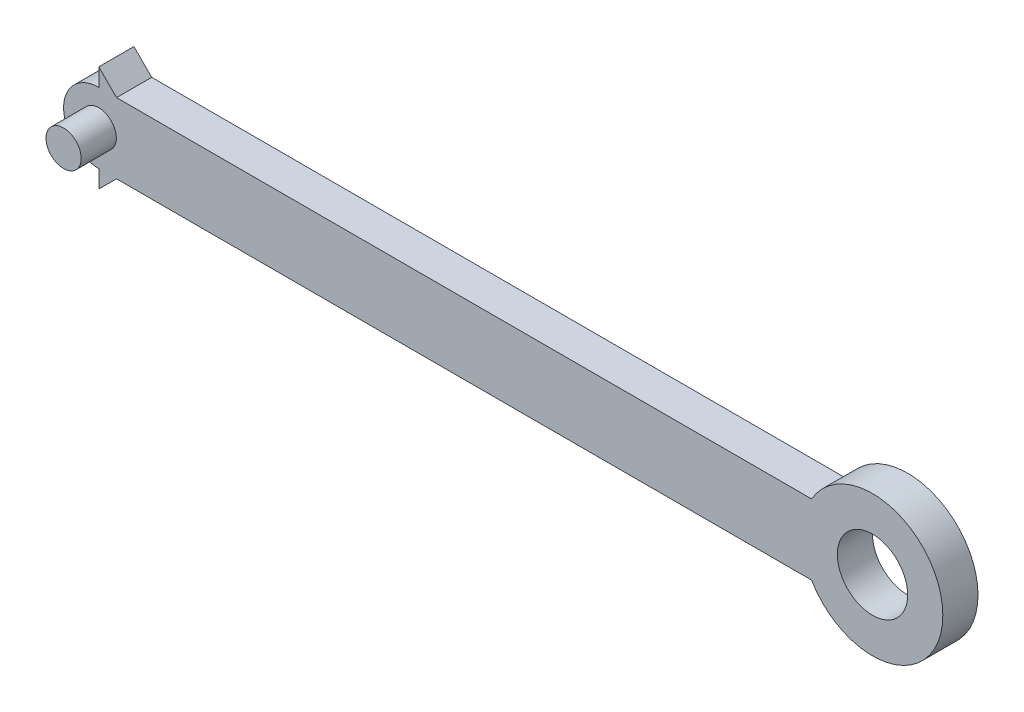
ISO-10303-21;
HEADER;
FILE_DESCRIPTION(('STEP AP214'),'2;1');
FILE_NAME('part.step','',(''),(''),'','','');
FILE_SCHEMA(('AUTOMOTIVE_DESIGN { 1 0 10303 214 1 1 1 1 }'));
ENDSEC;
DATA;
#1=APPLICATION_CONTEXT('core data for automotive mechanical design processes');
#2=APPLICATION_PROTOCOL_DEFINITION('international standard','automotive_design',2000,#1);
#3=PRODUCT_CONTEXT('',#1,'mechanical');
#4=PRODUCT('Part','Part','',(#3));
#5=PRODUCT_RELATED_PRODUCT_CATEGORY('part','',(#4));
#6=PRODUCT_DEFINITION_FORMATION('','',#4);
#7=PRODUCT_DEFINITION_CONTEXT('part definition',#1,'design');
#8=PRODUCT_DEFINITION('design','',#6,#7);
#9=PRODUCT_DEFINITION_SHAPE('','',#8);
#10=(LENGTH_UNIT() NAMED_UNIT(*) SI_UNIT(.MILLI.,.METRE.));
#11=(NAMED_UNIT(*) PLANE_ANGLE_UNIT() SI_UNIT($,.RADIAN.));
#12=(NAMED_UNIT(*) SI_UNIT($,.STERADIAN.) SOLID_ANGLE_UNIT());
#13=UNCERTAINTY_MEASURE_WITH_UNIT(LENGTH_MEASURE(1.E-05),#10,'distance_accuracy_value','');
#14=(GEOMETRIC_REPRESENTATION_CONTEXT(3) GLOBAL_UNCERTAINTY_ASSIGNED_CONTEXT((#13)) GLOBAL_UNIT_ASSIGNED_CONTEXT((#10,
#11,#12)) REPRESENTATION_CONTEXT('',''));
#15=CARTESIAN_POINT('',(0.,0.,0.));
#16=DIRECTION('',(0.,0.,1.));
#17=DIRECTION('',(1.,0.,0.));
#18=AXIS2_PLACEMENT_3D('',#15,#16,#17);
#19=CARTESIAN_POINT('',(-220.,0.,20.));
#20=DIRECTION('',(0.,0.,-1.));
#21=DIRECTION('',(-1.,0.,0.));
#22=AXIS2_PLACEMENT_3D('',#19,#20,#21);
#23=CYLINDRICAL_SURFACE('',#22,20.);
#24=CARTESIAN_POINT('',(-220.,0.,0.));
#25=DIRECTION('',(0.,0.,1.));
#26=DIRECTION('',(1.,0.,0.));
#27=AXIS2_PLACEMENT_3D('',#24,#25,#26);
#28=CIRCLE('',#27,20.);
#29=CARTESIAN_POINT('',(-220.,20.,0.));
#30=VERTEX_POINT('',#29);
#31=CARTESIAN_POINT('',(-220.,-20.,0.));
#32=VERTEX_POINT('',#31);
#33=EDGE_CURVE('E115',#30,#32,#28,.T.);
#34=ORIENTED_EDGE('',*,*,#33,.T.);
#35=DIRECTION('',(0.,0.,-1.));
#36=VECTOR('',#35,1.);
#37=CARTESIAN_POINT('',(-220.,-20.,20.));
#38=LINE('',#37,#36);
#39=CARTESIAN_POINT('',(-220.,-20.,20.));
#40=VERTEX_POINT('',#39);
#41=EDGE_CURVE('E11',#40,#32,#38,.T.);
#42=ORIENTED_EDGE('',*,*,#41,.F.);
#43=CARTESIAN_POINT('',(-220.,0.,20.));
#44=DIRECTION('',(0.,0.,1.));
#45=DIRECTION('',(1.,0.,0.));
#46=AXIS2_PLACEMENT_3D('',#43,#44,#45);
#47=CIRCLE('',#46,20.);
#48=CARTESIAN_POINT('',(-220.,20.,20.));
#49=VERTEX_POINT('',#48);
#50=EDGE_CURVE('E160',#49,#40,#47,.T.);
#51=ORIENTED_EDGE('',*,*,#50,.F.);
#52=DIRECTION('',(0.,0.,-1.));
#53=VECTOR('',#52,1.);
#54=CARTESIAN_POINT('',(-220.,20.,20.));
#55=LINE('',#54,#53);
#56=EDGE_CURVE('E44',#49,#30,#55,.T.);
#57=ORIENTED_EDGE('',*,*,#56,.T.);
#58=EDGE_LOOP('',(#34,#42,#51,#57));
#59=FACE_BOUND('',#58,.T.);
#60=ADVANCED_FACE('F37',(#59),#23,.T.);
#61=CARTESIAN_POINT('',(-220.,-20.,20.));
#62=DIRECTION('',(0.,1.,0.));
#63=DIRECTION('',(0.,0.,1.));
#64=AXIS2_PLACEMENT_3D('',#61,#62,#63);
#65=PLANE('',#64);
#66=DIRECTION('',(1.,0.,0.));
#67=VECTOR('',#66,1.);
#68=CARTESIAN_POINT('',(-220.,-20.,20.));
#69=LINE('',#68,#67);
#70=CARTESIAN_POINT('',(-209.887839651289,-20.,20.));
#71=VERTEX_POINT('',#70);
#72=CARTESIAN_POINT('',(185.358983848623,-20.,20.));
#73=VERTEX_POINT('',#72);
#74=EDGE_CURVE('E59',#71,#73,#69,.T.);
#75=ORIENTED_EDGE('',*,*,#74,.F.);
#76=DIRECTION('',(0.,0.,1.));
#77=VECTOR('',#76,1.);
#78=CARTESIAN_POINT('',(-209.887839651289,-20.,0.));
#79=LINE('',#78,#77);
#80=CARTESIAN_POINT('',(-209.887839651289,-20.,0.));
#81=VERTEX_POINT('',#80);
#82=EDGE_CURVE('E138',#81,#71,#79,.T.);
#83=ORIENTED_EDGE('',*,*,#82,.F.);
#84=DIRECTION('',(1.,0.,0.));
#85=VECTOR('',#84,1.);
#86=CARTESIAN_POINT('',(-220.,-20.,0.));
#87=LINE('',#86,#85);
#88=CARTESIAN_POINT('',(185.358983848623,-20.,0.));
#89=VERTEX_POINT('',#88);
#90=EDGE_CURVE('E167',#81,#89,#87,.T.);
#91=ORIENTED_EDGE('',*,*,#90,.T.);
#92=DIRECTION('',(0.,0.,1.));
#93=VECTOR('',#92,1.);
#94=CARTESIAN_POINT('',(185.358983848623,-20.,0.));
#95=LINE('',#94,#93);
#96=EDGE_CURVE('E155',#89,#73,#95,.T.);
#97=ORIENTED_EDGE('',*,*,#96,.T.);
#98=EDGE_LOOP('',(#75,#83,#91,#97));
#99=FACE_BOUND('',#98,.T.);
#100=ADVANCED_FACE('F185',(#99),#65,.F.);
#101=CARTESIAN_POINT('',(-220.,20.,20.));
#102=DIRECTION('',(0.,1.,0.));
#103=DIRECTION('',(0.,0.,1.));
#104=AXIS2_PLACEMENT_3D('',#101,#102,#103);
#105=PLANE('',#104);
#106=DIRECTION('',(0.,0.,1.));
#107=VECTOR('',#106,1.);
#108=CARTESIAN_POINT('',(-209.887839651289,20.,0.));
#109=LINE('',#108,#107);
#110=CARTESIAN_POINT('',(-209.887839651289,20.,0.));
#111=VERTEX_POINT('',#110);
#112=CARTESIAN_POINT('',(-209.887839651289,20.,20.));
#113=VERTEX_POINT('',#112);
#114=EDGE_CURVE('E110',#111,#113,#109,.T.);
#115=ORIENTED_EDGE('',*,*,#114,.T.);
#116=DIRECTION('',(1.,0.,0.));
#117=VECTOR('',#116,1.);
#118=CARTESIAN_POINT('',(-220.,20.,20.));
#119=LINE('',#118,#117);
#120=CARTESIAN_POINT('',(185.358983848623,20.,20.));
#121=VERTEX_POINT('',#120);
#122=EDGE_CURVE('E164',#113,#121,#119,.T.);
#123=ORIENTED_EDGE('',*,*,#122,.T.);
#124=DIRECTION('',(0.,0.,1.));
#125=VECTOR('',#124,1.);
#126=CARTESIAN_POINT('',(185.358983848623,20.,0.));
#127=LINE('',#126,#125);
#128=CARTESIAN_POINT('',(185.358983848623,20.,0.));
#129=VERTEX_POINT('',#128);
#130=EDGE_CURVE('E150',#129,#121,#127,.T.);
#131=ORIENTED_EDGE('',*,*,#130,.F.);
#132=DIRECTION('',(1.,0.,0.));
#133=VECTOR('',#132,1.);
#134=CARTESIAN_POINT('',(-220.,20.,0.));
#135=LINE('',#134,#133);
#136=EDGE_CURVE('E162',#111,#129,#135,.T.);
#137=ORIENTED_EDGE('',*,*,#136,.F.);
#138=EDGE_LOOP('',(#115,#123,#131,#137));
#139=FACE_BOUND('',#138,.T.);
#140=ADVANCED_FACE('F177',(#139),#105,.T.);
#141=CARTESIAN_POINT('',(-220.,0.,20.));
#142=DIRECTION('',(0.,0.,1.));
#143=DIRECTION('',(1.,0.,0.));
#144=AXIS2_PLACEMENT_3D('',#141,#142,#143);
#145=PLANE('',#144);
#146=CARTESIAN_POINT('',(220.,0.,20.));
#147=DIRECTION('',(0.,0.,-1.));
#148=DIRECTION('',(-1.,0.,0.));
#149=AXIS2_PLACEMENT_3D('',#146,#147,#148);
#150=CIRCLE('',#149,20.);
#151=CARTESIAN_POINT('',(200.,0.,20.));
#152=VERTEX_POINT('',#151);
#153=EDGE_CURVE('E127',#152,#152,#150,.T.);
#154=ORIENTED_EDGE('',*,*,#153,.T.);
#155=EDGE_LOOP('',(#154));
#156=FACE_BOUND('',#155,.T.);
#157=ORIENTED_EDGE('',*,*,#50,.T.);
#158=DIRECTION('',(0.,-1.,0.));
#159=VECTOR('',#158,1.);
#160=CARTESIAN_POINT('',(-220.,-20.,20.));
#161=LINE('',#160,#159);
#162=CARTESIAN_POINT('',(-220.,-30.1121603487118,20.));
#163=VERTEX_POINT('',#162);
#164=EDGE_CURVE('E135',#40,#163,#161,.T.);
#165=ORIENTED_EDGE('',*,*,#164,.T.);
#166=DIRECTION('',(0.707106781186534,0.707106781186561,0.));
#167=VECTOR('',#166,1.);
#168=CARTESIAN_POINT('',(-220.,-30.1121603487118,20.));
#169=LINE('',#168,#167);
#170=EDGE_CURVE('E129',#163,#71,#169,.T.);
#171=ORIENTED_EDGE('',*,*,#170,.T.);
#172=ORIENTED_EDGE('',*,*,#74,.T.);
#173=CARTESIAN_POINT('',(220.,0.,20.));
#174=DIRECTION('',(0.,0.,1.));
#175=DIRECTION('',(1.,0.,0.));
#176=AXIS2_PLACEMENT_3D('',#173,#174,#175);
#177=CIRCLE('',#176,40.);
#178=EDGE_CURVE('E145',#73,#121,#177,.T.);
#179=ORIENTED_EDGE('',*,*,#178,.T.);
#180=ORIENTED_EDGE('',*,*,#122,.F.);
#181=DIRECTION('',(-0.707106781186533,0.707106781186562,0.));
#182=VECTOR('',#181,1.);
#183=CARTESIAN_POINT('',(-220.,30.1121603487118,20.));
#184=LINE('',#183,#182);
#185=CARTESIAN_POINT('',(-220.,30.1121603487118,20.));
#186=VERTEX_POINT('',#185);
#187=EDGE_CURVE('E121',#113,#186,#184,.T.);
#188=ORIENTED_EDGE('',*,*,#187,.T.);
#189=DIRECTION('',(0.,-1.,0.));
#190=VECTOR('',#189,1.);
#191=CARTESIAN_POINT('',(-220.,20.,20.));
#192=LINE('',#191,#190);
#193=EDGE_CURVE('E107',#186,#49,#192,.T.);
#194=ORIENTED_EDGE('',*,*,#193,.T.);
#195=EDGE_LOOP('',(#157,#165,#171,#172,#179,#180,#188,#194));
#196=FACE_BOUND('',#195,.T.);
#197=CARTESIAN_POINT('',(-220.,0.,20.));
#198=DIRECTION('',(0.,0.,1.));
#199=DIRECTION('',(1.,0.,0.));
#200=AXIS2_PLACEMENT_3D('',#197,#198,#199);
#201=CIRCLE('',#200,10.);
#202=CARTESIAN_POINT('',(-210.,0.,20.));
#203=VERTEX_POINT('',#202);
#204=EDGE_CURVE('E157',#203,#203,#201,.T.);
#205=ORIENTED_EDGE('',*,*,#204,.F.);
#206=EDGE_LOOP('',(#205));
#207=FACE_BOUND('',#206,.T.);
#208=ADVANCED_FACE('F173',(#156,#196,#207),#145,.T.);
#209=CARTESIAN_POINT('',(-220.,0.,0.));
#210=DIRECTION('',(0.,0.,1.));
#211=DIRECTION('',(1.,0.,0.));
#212=AXIS2_PLACEMENT_3D('',#209,#210,#211);
#213=PLANE('',#212);
#214=CARTESIAN_POINT('',(220.,0.,0.));
#215=DIRECTION('',(0.,0.,-1.));
#216=DIRECTION('',(-1.,0.,0.));
#217=AXIS2_PLACEMENT_3D('',#214,#215,#216);
#218=CIRCLE('',#217,20.);
#219=CARTESIAN_POINT('',(200.,0.,0.));
#220=VERTEX_POINT('',#219);
#221=EDGE_CURVE('E124',#220,#220,#218,.T.);
#222=ORIENTED_EDGE('',*,*,#221,.F.);
#223=EDGE_LOOP('',(#222));
#224=FACE_BOUND('',#223,.T.);
#225=ORIENTED_EDGE('',*,*,#33,.F.);
#226=DIRECTION('',(0.,-1.,0.));
#227=VECTOR('',#226,1.);
#228=CARTESIAN_POINT('',(-220.,20.,0.));
#229=LINE('',#228,#227);
#230=CARTESIAN_POINT('',(-220.,30.1121603487118,0.));
#231=VERTEX_POINT('',#230);
#232=EDGE_CURVE('E104',#231,#30,#229,.T.);
#233=ORIENTED_EDGE('',*,*,#232,.F.);
#234=DIRECTION('',(-0.707106781186533,0.707106781186562,0.));
#235=VECTOR('',#234,1.);
#236=CARTESIAN_POINT('',(-220.,30.1121603487118,0.));
#237=LINE('',#236,#235);
#238=EDGE_CURVE('E51',#111,#231,#237,.T.);
#239=ORIENTED_EDGE('',*,*,#238,.F.);
#240=ORIENTED_EDGE('',*,*,#136,.T.);
#241=CARTESIAN_POINT('',(220.,0.,0.));
#242=DIRECTION('',(0.,0.,1.));
#243=DIRECTION('',(1.,0.,0.));
#244=AXIS2_PLACEMENT_3D('',#241,#242,#243);
#245=CIRCLE('',#244,40.);
#246=EDGE_CURVE('E147',#89,#129,#245,.T.);
#247=ORIENTED_EDGE('',*,*,#246,.F.);
#248=ORIENTED_EDGE('',*,*,#90,.F.);
#249=DIRECTION('',(0.707106781186534,0.707106781186561,0.));
#250=VECTOR('',#249,1.);
#251=CARTESIAN_POINT('',(-220.,-30.1121603487118,0.));
#252=LINE('',#251,#250);
#253=CARTESIAN_POINT('',(-220.,-30.1121603487118,0.));
#254=VERTEX_POINT('',#253);
#255=EDGE_CURVE('E131',#254,#81,#252,.T.);
#256=ORIENTED_EDGE('',*,*,#255,.F.);
#257=DIRECTION('',(0.,-1.,0.));
#258=VECTOR('',#257,1.);
#259=CARTESIAN_POINT('',(-220.,-20.,0.));
#260=LINE('',#259,#258);
#261=EDGE_CURVE('E134',#32,#254,#260,.T.);
#262=ORIENTED_EDGE('',*,*,#261,.F.);
#263=EDGE_LOOP('',(#225,#233,#239,#240,#247,#248,#256,#262));
#264=FACE_BOUND('',#263,.T.);
#265=ADVANCED_FACE('F113',(#224,#264),#213,.F.);
#266=CARTESIAN_POINT('',(220.,0.,0.));
#267=DIRECTION('',(0.,0.,1.));
#268=DIRECTION('',(1.,0.,0.));
#269=AXIS2_PLACEMENT_3D('',#266,#267,#268);
#270=CYLINDRICAL_SURFACE('',#269,40.);
#271=ORIENTED_EDGE('',*,*,#96,.F.);
#272=ORIENTED_EDGE('',*,*,#246,.T.);
#273=ORIENTED_EDGE('',*,*,#130,.T.);
#274=ORIENTED_EDGE('',*,*,#178,.F.);
#275=EDGE_LOOP('',(#271,#272,#273,#274));
#276=FACE_BOUND('',#275,.T.);
#277=ADVANCED_FACE('F183',(#276),#270,.T.);
#278=CARTESIAN_POINT('',(-220.,-30.1121603487118,0.));
#279=DIRECTION('',(0.707106781186561,-0.707106781186534,0.));
#280=DIRECTION('',(0.707106781186534,0.707106781186561,0.));
#281=AXIS2_PLACEMENT_3D('',#278,#279,#280);
#282=PLANE('',#281);
#283=ORIENTED_EDGE('',*,*,#170,.F.);
#284=DIRECTION('',(0.,0.,1.));
#285=VECTOR('',#284,1.);
#286=CARTESIAN_POINT('',(-220.,-30.1121603487118,0.));
#287=LINE('',#286,#285);
#288=EDGE_CURVE('E143',#254,#163,#287,.T.);
#289=ORIENTED_EDGE('',*,*,#288,.F.);
#290=ORIENTED_EDGE('',*,*,#255,.T.);
#291=ORIENTED_EDGE('',*,*,#82,.T.);
#292=EDGE_LOOP('',(#283,#289,#290,#291));
#293=FACE_BOUND('',#292,.T.);
#294=ADVANCED_FACE('F188',(#293),#282,.T.);
#295=CARTESIAN_POINT('',(-220.,-20.,0.));
#296=DIRECTION('',(-1.,0.,0.));
#297=DIRECTION('',(0.,0.,1.));
#298=AXIS2_PLACEMENT_3D('',#295,#296,#297);
#299=PLANE('',#298);
#300=ORIENTED_EDGE('',*,*,#164,.F.);
#301=ORIENTED_EDGE('',*,*,#41,.T.);
#302=ORIENTED_EDGE('',*,*,#261,.T.);
#303=ORIENTED_EDGE('',*,*,#288,.T.);
#304=EDGE_LOOP('',(#300,#301,#302,#303));
#305=FACE_BOUND('',#304,.T.);
#306=ADVANCED_FACE('F191',(#305),#299,.T.);
#307=CARTESIAN_POINT('',(-220.,30.1121603487118,0.));
#308=DIRECTION('',(0.707106781186562,0.707106781186533,0.));
#309=DIRECTION('',(-0.707106781186533,0.707106781186562,0.));
#310=AXIS2_PLACEMENT_3D('',#307,#308,#309);
#311=PLANE('',#310);
#312=ORIENTED_EDGE('',*,*,#187,.F.);
#313=ORIENTED_EDGE('',*,*,#114,.F.);
#314=ORIENTED_EDGE('',*,*,#238,.T.);
#315=DIRECTION('',(0.,0.,1.));
#316=VECTOR('',#315,1.);
#317=CARTESIAN_POINT('',(-220.,30.1121603487118,0.));
#318=LINE('',#317,#316);
#319=EDGE_CURVE('E102',#231,#186,#318,.T.);
#320=ORIENTED_EDGE('',*,*,#319,.T.);
#321=EDGE_LOOP('',(#312,#313,#314,#320));
#322=FACE_BOUND('',#321,.T.);
#323=ADVANCED_FACE('F117',(#322),#311,.T.);
#324=CARTESIAN_POINT('',(-220.,20.,0.));
#325=DIRECTION('',(-1.,0.,0.));
#326=DIRECTION('',(0.,0.,1.));
#327=AXIS2_PLACEMENT_3D('',#324,#325,#326);
#328=PLANE('',#327);
#329=ORIENTED_EDGE('',*,*,#193,.F.);
#330=ORIENTED_EDGE('',*,*,#319,.F.);
#331=ORIENTED_EDGE('',*,*,#232,.T.);
#332=ORIENTED_EDGE('',*,*,#56,.F.);
#333=EDGE_LOOP('',(#329,#330,#331,#332));
#334=FACE_BOUND('',#333,.T.);
#335=ADVANCED_FACE('F103',(#334),#328,.T.);
#336=CARTESIAN_POINT('',(220.,0.,20.));
#337=DIRECTION('',(0.,0.,-1.));
#338=DIRECTION('',(-1.,0.,0.));
#339=AXIS2_PLACEMENT_3D('',#336,#337,#338);
#340=CYLINDRICAL_SURFACE('',#339,20.);
#341=ORIENTED_EDGE('',*,*,#153,.F.);
#342=EDGE_LOOP('',(#341));
#343=FACE_BOUND('',#342,.T.);
#344=ORIENTED_EDGE('',*,*,#221,.T.);
#345=EDGE_LOOP('',(#344));
#346=FACE_BOUND('',#345,.T.);
#347=ADVANCED_FACE('F247',(#343,#346),#340,.F.);
#348=CARTESIAN_POINT('',(-220.,0.,39.9999999999999));
#349=DIRECTION('',(0.,0.,-1.));
#350=DIRECTION('',(-1.,0.,0.));
#351=AXIS2_PLACEMENT_3D('',#348,#349,#350);
#352=CYLINDRICAL_SURFACE('',#351,10.);
#353=ORIENTED_EDGE('',*,*,#204,.T.);
#354=EDGE_LOOP('',(#353));
#355=FACE_BOUND('',#354,.T.);
#356=CARTESIAN_POINT('',(-220.,0.,39.9999999999999));
#357=DIRECTION('',(0.,0.,-1.));
#358=DIRECTION('',(-1.,0.,0.));
#359=AXIS2_PLACEMENT_3D('',#356,#357,#358);
#360=CIRCLE('',#359,10.);
#361=CARTESIAN_POINT('',(-230.,0.,39.9999999999999));
#362=VERTEX_POINT('',#361);
#363=EDGE_CURVE('E294',#362,#362,#360,.T.);
#364=ORIENTED_EDGE('',*,*,#363,.T.);
#365=EDGE_LOOP('',(#364));
#366=FACE_BOUND('',#365,.T.);
#367=ADVANCED_FACE('F263',(#355,#366),#352,.T.);
#368=CARTESIAN_POINT('',(-220.,0.,39.9999999999999));
#369=DIRECTION('',(0.,0.,-1.));
#370=DIRECTION('',(-1.,0.,0.));
#371=AXIS2_PLACEMENT_3D('',#368,#369,#370);
#372=PLANE('',#371);
#373=ORIENTED_EDGE('',*,*,#363,.F.);
#374=EDGE_LOOP('',(#373));
#375=FACE_BOUND('',#374,.T.);
#376=ADVANCED_FACE('F278',(#375),#372,.F.);
#377=CLOSED_SHELL('',(#60,#100,#140,#208,#265,#277,#294,#306,#323,#335,#347,#367,#376));
#378=MANIFOLD_SOLID_BREP('B2',#377);
#379=ADVANCED_BREP_SHAPE_REPRESENTATION('',(#18,#378),#14);
#380=SHAPE_DEFINITION_REPRESENTATION(#9,#379);
ENDSEC;
END-ISO-10303-21;
